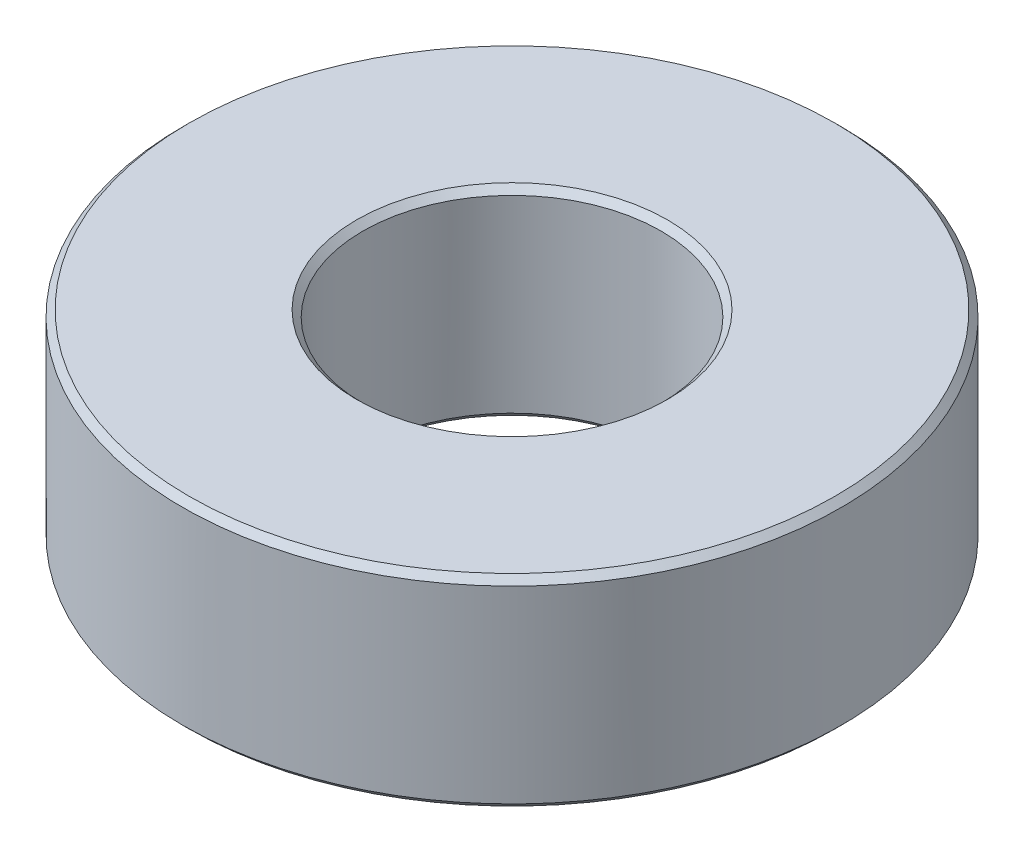
ISO-10303-21;
HEADER;
FILE_DESCRIPTION(('STEP AP214'),'2;1');
FILE_NAME('part.step','',(''),(''),'','','');
FILE_SCHEMA(('AUTOMOTIVE_DESIGN { 1 0 10303 214 1 1 1 1 }'));
ENDSEC;
DATA;
#1=APPLICATION_CONTEXT('core data for automotive mechanical design processes');
#2=APPLICATION_PROTOCOL_DEFINITION('international standard','automotive_design',2000,#1);
#3=PRODUCT_CONTEXT('',#1,'mechanical');
#4=PRODUCT('Part','Part','',(#3));
#5=PRODUCT_RELATED_PRODUCT_CATEGORY('part','',(#4));
#6=PRODUCT_DEFINITION_FORMATION('','',#4);
#7=PRODUCT_DEFINITION_CONTEXT('part definition',#1,'design');
#8=PRODUCT_DEFINITION('design','',#6,#7);
#9=PRODUCT_DEFINITION_SHAPE('','',#8);
#10=(LENGTH_UNIT() NAMED_UNIT(*) SI_UNIT(.MILLI.,.METRE.));
#11=(NAMED_UNIT(*) PLANE_ANGLE_UNIT() SI_UNIT($,.RADIAN.));
#12=(NAMED_UNIT(*) SI_UNIT($,.STERADIAN.) SOLID_ANGLE_UNIT());
#13=UNCERTAINTY_MEASURE_WITH_UNIT(LENGTH_MEASURE(1.E-05),#10,'distance_accuracy_value','');
#14=(GEOMETRIC_REPRESENTATION_CONTEXT(3) GLOBAL_UNCERTAINTY_ASSIGNED_CONTEXT((#13)) GLOBAL_UNIT_ASSIGNED_CONTEXT((#10,
#11,#12)) REPRESENTATION_CONTEXT('',''));
#15=CARTESIAN_POINT('',(0.,0.,0.));
#16=DIRECTION('',(0.,0.,1.));
#17=DIRECTION('',(1.,0.,0.));
#18=AXIS2_PLACEMENT_3D('',#15,#16,#17);
#19=CARTESIAN_POINT('',(0.,13.7566805778273,0.));
#20=DIRECTION('',(0.,-1.,0.));
#21=DIRECTION('',(0.,0.,-1.));
#22=AXIS2_PLACEMENT_3D('',#19,#20,#21);
#23=CYLINDRICAL_SURFACE('',#22,22.5);
#24=CARTESIAN_POINT('',(0.,0.439516896220526,0.));
#25=DIRECTION('',(0.,1.,0.));
#26=DIRECTION('',(0.,0.,1.));
#27=AXIS2_PLACEMENT_3D('',#24,#25,#26);
#28=CIRCLE('',#27,22.5);
#29=CARTESIAN_POINT('',(0.,0.439516896220524,-22.5));
#30=VERTEX_POINT('',#29);
#31=EDGE_CURVE('E10',#30,#30,#28,.T.);
#32=CARTESIAN_POINT('',(0.,13.3171636816068,0.));
#33=DIRECTION('',(0.,1.,0.));
#34=DIRECTION('',(0.,0.,1.));
#35=AXIS2_PLACEMENT_3D('',#32,#33,#34);
#36=CIRCLE('',#35,22.5);
#37=CARTESIAN_POINT('',(0.,13.3171636816068,-22.5));
#38=VERTEX_POINT('',#37);
#39=EDGE_CURVE('E50',#38,#38,#36,.F.);
#40=CARTESIAN_POINT('',(0.,0.439516896220524,-22.5));
#41=CARTESIAN_POINT('',(0.,0.573659050234965,-22.5));
#42=CARTESIAN_POINT('',(0.,0.707801204249406,-22.5));
#43=CARTESIAN_POINT('',(0.,0.976085512278287,-22.5));
#44=CARTESIAN_POINT('',(0.,1.11022766629273,-22.5));
#45=CARTESIAN_POINT('',(0.,1.37851197432161,-22.5));
#46=CARTESIAN_POINT('',(0.,1.51265412833605,-22.5));
#47=CARTESIAN_POINT('',(0.,1.78093843636493,-22.5));
#48=CARTESIAN_POINT('',(0.,1.91508059037937,-22.5));
#49=CARTESIAN_POINT('',(0.,2.18336489840825,-22.5));
#50=CARTESIAN_POINT('',(0.,2.31750705242269,-22.5));
#51=CARTESIAN_POINT('',(0.,2.58579136045158,-22.5));
#52=CARTESIAN_POINT('',(0.,2.71993351446602,-22.5));
#53=CARTESIAN_POINT('',(0.,2.9882178224949,-22.5));
#54=CARTESIAN_POINT('',(0.,3.12235997650934,-22.5));
#55=CARTESIAN_POINT('',(0.,3.39064428453822,-22.5));
#56=CARTESIAN_POINT('',(0.,3.52478643855266,-22.5));
#57=CARTESIAN_POINT('',(0.,3.79307074658154,-22.5));
#58=CARTESIAN_POINT('',(0.,3.92721290059598,-22.5));
#59=CARTESIAN_POINT('',(0.,4.19549720862486,-22.5));
#60=CARTESIAN_POINT('',(0.,4.3296393626393,-22.5));
#61=CARTESIAN_POINT('',(0.,4.59792367066819,-22.5));
#62=CARTESIAN_POINT('',(0.,4.73206582468263,-22.5));
#63=CARTESIAN_POINT('',(0.,5.00035013271151,-22.5));
#64=CARTESIAN_POINT('',(0.,5.13449228672595,-22.5));
#65=CARTESIAN_POINT('',(0.,5.40277659475483,-22.5));
#66=CARTESIAN_POINT('',(0.,5.53691874876927,-22.5));
#67=CARTESIAN_POINT('',(0.,5.80520305679815,-22.5));
#68=CARTESIAN_POINT('',(0.,5.93934521081259,-22.5));
#69=CARTESIAN_POINT('',(0.,6.20762951884147,-22.5));
#70=CARTESIAN_POINT('',(0.,6.34177167285592,-22.5));
#71=CARTESIAN_POINT('',(0.,6.6100559808848,-22.5));
#72=CARTESIAN_POINT('',(0.,6.74419813489924,-22.5));
#73=CARTESIAN_POINT('',(0.,7.01248244292812,-22.5));
#74=CARTESIAN_POINT('',(0.,7.14662459694256,-22.5));
#75=CARTESIAN_POINT('',(0.,7.41490890497144,-22.5));
#76=CARTESIAN_POINT('',(0.,7.54905105898588,-22.5));
#77=CARTESIAN_POINT('',(0.,7.81733536701476,-22.5));
#78=CARTESIAN_POINT('',(0.,7.9514775210292,-22.5));
#79=CARTESIAN_POINT('',(0.,8.21976182905808,-22.5));
#80=CARTESIAN_POINT('',(0.,8.35390398307253,-22.5));
#81=CARTESIAN_POINT('',(0.,8.62218829110141,-22.5));
#82=CARTESIAN_POINT('',(0.,8.75633044511585,-22.5));
#83=CARTESIAN_POINT('',(0.,9.02461475314473,-22.5));
#84=CARTESIAN_POINT('',(0.,9.15875690715917,-22.5));
#85=CARTESIAN_POINT('',(0.,9.42704121518805,-22.5));
#86=CARTESIAN_POINT('',(0.,9.56118336920249,-22.5));
#87=CARTESIAN_POINT('',(0.,9.82946767723137,-22.5));
#88=CARTESIAN_POINT('',(0.,9.96360983124581,-22.5));
#89=CARTESIAN_POINT('',(0.,10.2318941392747,-22.5));
#90=CARTESIAN_POINT('',(0.,10.3660362932891,-22.5));
#91=CARTESIAN_POINT('',(0.,10.634320601318,-22.5));
#92=CARTESIAN_POINT('',(0.,10.7684627553325,-22.5));
#93=CARTESIAN_POINT('',(0.,11.0367470633613,-22.5));
#94=CARTESIAN_POINT('',(0.,11.1708892173758,-22.5));
#95=CARTESIAN_POINT('',(0.,11.4391735254047,-22.5));
#96=CARTESIAN_POINT('',(0.,11.5733156794191,-22.5));
#97=CARTESIAN_POINT('',(0.,11.841599987448,-22.5));
#98=CARTESIAN_POINT('',(0.,11.9757421414624,-22.5));
#99=CARTESIAN_POINT('',(0.,12.2440264494913,-22.5));
#100=CARTESIAN_POINT('',(0.,12.3781686035057,-22.5));
#101=CARTESIAN_POINT('',(0.,12.6464529115346,-22.5));
#102=CARTESIAN_POINT('',(0.,12.7805950655491,-22.5));
#103=CARTESIAN_POINT('',(0.,13.0488793735779,-22.5));
#104=CARTESIAN_POINT('',(0.,13.1830215275924,-22.5));
#105=CARTESIAN_POINT('',(0.,13.3171636816068,-22.5));
#106=B_SPLINE_CURVE_WITH_KNOTS('',3,(#40,#41,#42,#43,#44,#45,#46,#47,#48,#49,#50,#51,#52,#53,
#54,#55,#56,#57,#58,#59,#60,#61,#62,#63,#64,#65,#66,#67,#68,#69,#70,#71,#72,#73,#74,#75,#76,#77,
#78,#79,#80,#81,#82,#83,#84,#85,#86,#87,#88,#89,#90,#91,#92,#93,#94,#95,#96,#97,#98,#99,#100,
#101,#102,#103,#104,#105),.UNSPECIFIED.,.F.,.F.,(4,2,2,2,2,2,2,2,2,2,2,2,2,2,2,2,2,2,2,2,2,2,2,
2,2,2,2,2,2,2,2,2,4),(0.,0.402426462043323,0.804852924086644,1.20727938612997,1.60970584817329,
2.01213231021661,2.41455877225993,2.81698523430325,3.21941169634658,3.6218381583899,
4.02426462043322,4.42669108247654,4.82911754451987,5.23154400656319,5.63397046860651,
6.03639693064983,6.43882339269315,6.84124985473648,7.2436763167798,7.64610277882312,
8.04852924086644,8.45095570290976,8.85338216495309,9.25580862699641,9.65823508903973,
10.0606615510831,10.4630880131264,10.8655144751697,11.267940937213,11.6703673992563,
12.0727938612997,12.475220323343,12.8776467853863),.UNSPECIFIED.);
#107=EDGE_CURVE('BSEAM39',#30,#38,#106,.T.);
#108=ORIENTED_EDGE('',*,*,#31,.T.);
#109=ORIENTED_EDGE('',*,*,#39,.T.);
#110=ORIENTED_EDGE('',*,*,#107,.T.);
#111=ORIENTED_EDGE('',*,*,#107,.F.);
#112=EDGE_LOOP('',(#108,#110,#109,#111));
#113=FACE_BOUND('',#112,.T.);
#114=ADVANCED_FACE('F39',(#113),#23,.T.);
#115=CARTESIAN_POINT('',(0.,13.7566805778273,0.));
#116=DIRECTION('',(0.,1.,0.));
#117=DIRECTION('',(0.,0.,1.));
#118=AXIS2_PLACEMENT_3D('',#115,#116,#117);
#119=PLANE('',#118);
#120=CARTESIAN_POINT('',(0.,13.7566805778273,0.));
#121=DIRECTION('',(0.,1.,0.));
#122=DIRECTION('',(0.,0.,1.));
#123=AXIS2_PLACEMENT_3D('',#120,#121,#122);
#124=CIRCLE('',#123,10.6208630316063);
#125=CARTESIAN_POINT('',(0.,13.7566805778273,10.6208630316063));
#126=VERTEX_POINT('',#125);
#127=EDGE_CURVE('E58',#126,#126,#124,.F.);
#128=ORIENTED_EDGE('',*,*,#127,.T.);
#129=EDGE_LOOP('',(#128));
#130=FACE_BOUND('',#129,.T.);
#131=CARTESIAN_POINT('',(0.,13.7566805778273,0.));
#132=DIRECTION('',(0.,1.,0.));
#133=DIRECTION('',(0.,0.,1.));
#134=AXIS2_PLACEMENT_3D('',#131,#132,#133);
#135=CIRCLE('',#134,22.0604831037795);
#136=CARTESIAN_POINT('',(0.,13.7566805778273,22.0604831037795));
#137=VERTEX_POINT('',#136);
#138=EDGE_CURVE('E61',#137,#137,#135,.T.);
#139=ORIENTED_EDGE('',*,*,#138,.T.);
#140=EDGE_LOOP('',(#139));
#141=FACE_BOUND('',#140,.T.);
#142=ADVANCED_FACE('F88',(#130,#141),#119,.T.);
#143=CARTESIAN_POINT('',(0.,0.,0.));
#144=DIRECTION('',(0.,1.,0.));
#145=DIRECTION('',(0.,0.,1.));
#146=AXIS2_PLACEMENT_3D('',#143,#144,#145);
#147=PLANE('',#146);
#148=CARTESIAN_POINT('',(0.,0.,0.));
#149=DIRECTION('',(0.,1.,0.));
#150=DIRECTION('',(0.,0.,1.));
#151=AXIS2_PLACEMENT_3D('',#148,#149,#150);
#152=CIRCLE('',#151,10.6208630316063);
#153=CARTESIAN_POINT('',(0.,0.,10.6208630316063));
#154=VERTEX_POINT('',#153);
#155=EDGE_CURVE('E51',#154,#154,#152,.T.);
#156=ORIENTED_EDGE('',*,*,#155,.T.);
#157=EDGE_LOOP('',(#156));
#158=FACE_BOUND('',#157,.T.);
#159=CARTESIAN_POINT('',(0.,0.,0.));
#160=DIRECTION('',(0.,1.,0.));
#161=DIRECTION('',(0.,0.,1.));
#162=AXIS2_PLACEMENT_3D('',#159,#160,#161);
#163=CIRCLE('',#162,22.0604831037795);
#164=CARTESIAN_POINT('',(0.,0.,22.0604831037795));
#165=VERTEX_POINT('',#164);
#166=EDGE_CURVE('E54',#165,#165,#163,.F.);
#167=ORIENTED_EDGE('',*,*,#166,.T.);
#168=EDGE_LOOP('',(#167));
#169=FACE_BOUND('',#168,.T.);
#170=ADVANCED_FACE('F83',(#158,#169),#147,.F.);
#171=CARTESIAN_POINT('',(0.,13.7566805778273,0.));
#172=DIRECTION('',(0.,-1.,0.));
#173=DIRECTION('',(0.,0.,-1.));
#174=AXIS2_PLACEMENT_3D('',#171,#172,#173);
#175=CYLINDRICAL_SURFACE('',#174,10.1813461353858);
#176=CARTESIAN_POINT('',(0.,13.3171636816068,0.));
#177=DIRECTION('',(0.,1.,0.));
#178=DIRECTION('',(0.,0.,1.));
#179=AXIS2_PLACEMENT_3D('',#176,#177,#178);
#180=CIRCLE('',#179,10.1813461353858);
#181=CARTESIAN_POINT('',(0.,13.3171636816068,-10.1813461353858));
#182=VERTEX_POINT('',#181);
#183=EDGE_CURVE('E67',#182,#182,#180,.T.);
#184=CARTESIAN_POINT('',(0.,0.439516896220482,0.));
#185=DIRECTION('',(0.,1.,0.));
#186=DIRECTION('',(0.,0.,1.));
#187=AXIS2_PLACEMENT_3D('',#184,#185,#186);
#188=CIRCLE('',#187,10.1813461353858);
#189=CARTESIAN_POINT('',(0.,0.439516896220482,-10.1813461353858));
#190=VERTEX_POINT('',#189);
#191=EDGE_CURVE('E69',#190,#190,#188,.F.);
#192=CARTESIAN_POINT('',(0.,13.3171636816068,-10.1813461353858));
#193=CARTESIAN_POINT('',(0.,13.1830215275924,-10.1813461353858));
#194=CARTESIAN_POINT('',(0.,13.0488793735779,-10.1813461353858));
#195=CARTESIAN_POINT('',(0.,12.780595065549,-10.1813461353858));
#196=CARTESIAN_POINT('',(0.,12.6464529115346,-10.1813461353858));
#197=CARTESIAN_POINT('',(0.,12.3781686035057,-10.1813461353858));
#198=CARTESIAN_POINT('',(0.,12.2440264494913,-10.1813461353858));
#199=CARTESIAN_POINT('',(0.,11.9757421414624,-10.1813461353858));
#200=CARTESIAN_POINT('',(0.,11.841599987448,-10.1813461353858));
#201=CARTESIAN_POINT('',(0.,11.5733156794191,-10.1813461353858));
#202=CARTESIAN_POINT('',(0.,11.4391735254046,-10.1813461353858));
#203=CARTESIAN_POINT('',(0.,11.1708892173758,-10.1813461353858));
#204=CARTESIAN_POINT('',(0.,11.0367470633613,-10.1813461353858));
#205=CARTESIAN_POINT('',(0.,10.7684627553324,-10.1813461353858));
#206=CARTESIAN_POINT('',(0.,10.634320601318,-10.1813461353858));
#207=CARTESIAN_POINT('',(0.,10.3660362932891,-10.1813461353858));
#208=CARTESIAN_POINT('',(0.,10.2318941392747,-10.1813461353858));
#209=CARTESIAN_POINT('',(0.,9.96360983124579,-10.1813461353858));
#210=CARTESIAN_POINT('',(0.,9.82946767723134,-10.1813461353858));
#211=CARTESIAN_POINT('',(0.,9.56118336920246,-10.1813461353858));
#212=CARTESIAN_POINT('',(0.,9.42704121518802,-10.1813461353858));
#213=CARTESIAN_POINT('',(0.,9.15875690715914,-10.1813461353858));
#214=CARTESIAN_POINT('',(0.,9.0246147531447,-10.1813461353858));
#215=CARTESIAN_POINT('',(0.,8.75633044511582,-10.1813461353858));
#216=CARTESIAN_POINT('',(0.,8.62218829110138,-10.1813461353858));
#217=CARTESIAN_POINT('',(0.,8.35390398307249,-10.1813461353858));
#218=CARTESIAN_POINT('',(0.,8.21976182905805,-10.1813461353858));
#219=CARTESIAN_POINT('',(0.,7.95147752102917,-10.1813461353858));
#220=CARTESIAN_POINT('',(0.,7.81733536701473,-10.1813461353858));
#221=CARTESIAN_POINT('',(0.,7.54905105898585,-10.1813461353858));
#222=CARTESIAN_POINT('',(0.,7.41490890497141,-10.1813461353858));
#223=CARTESIAN_POINT('',(0.,7.14662459694253,-10.1813461353858));
#224=CARTESIAN_POINT('',(0.,7.01248244292809,-10.1813461353858));
#225=CARTESIAN_POINT('',(0.,6.7441981348992,-10.1813461353858));
#226=CARTESIAN_POINT('',(0.,6.61005598088476,-10.1813461353858));
#227=CARTESIAN_POINT('',(0.,6.34177167285588,-10.1813461353858));
#228=CARTESIAN_POINT('',(0.,6.20762951884144,-10.1813461353858));
#229=CARTESIAN_POINT('',(0.,5.93934521081256,-10.1813461353858));
#230=CARTESIAN_POINT('',(0.,5.80520305679812,-10.1813461353858));
#231=CARTESIAN_POINT('',(0.,5.53691874876924,-10.1813461353858));
#232=CARTESIAN_POINT('',(0.,5.40277659475479,-10.1813461353858));
#233=CARTESIAN_POINT('',(0.,5.13449228672591,-10.1813461353858));
#234=CARTESIAN_POINT('',(0.,5.00035013271147,-10.1813461353858));
#235=CARTESIAN_POINT('',(0.,4.73206582468259,-10.1813461353858));
#236=CARTESIAN_POINT('',(0.,4.59792367066815,-10.1813461353858));
#237=CARTESIAN_POINT('',(0.,4.32963936263927,-10.1813461353858));
#238=CARTESIAN_POINT('',(0.,4.19549720862483,-10.1813461353858));
#239=CARTESIAN_POINT('',(0.,3.92721290059595,-10.1813461353858));
#240=CARTESIAN_POINT('',(0.,3.79307074658151,-10.1813461353858));
#241=CARTESIAN_POINT('',(0.,3.52478643855262,-10.1813461353858));
#242=CARTESIAN_POINT('',(0.,3.39064428453818,-10.1813461353858));
#243=CARTESIAN_POINT('',(0.,3.1223599765093,-10.1813461353858));
#244=CARTESIAN_POINT('',(0.,2.98821782249486,-10.1813461353858));
#245=CARTESIAN_POINT('',(0.,2.71993351446598,-10.1813461353858));
#246=CARTESIAN_POINT('',(0.,2.58579136045154,-10.1813461353858));
#247=CARTESIAN_POINT('',(0.,2.31750705242265,-10.1813461353858));
#248=CARTESIAN_POINT('',(0.,2.18336489840821,-10.1813461353858));
#249=CARTESIAN_POINT('',(0.,1.91508059037933,-10.1813461353858));
#250=CARTESIAN_POINT('',(0.,1.78093843636489,-10.1813461353858));
#251=CARTESIAN_POINT('',(0.,1.51265412833601,-10.1813461353858));
#252=CARTESIAN_POINT('',(0.,1.37851197432157,-10.1813461353858));
#253=CARTESIAN_POINT('',(0.,1.11022766629269,-10.1813461353858));
#254=CARTESIAN_POINT('',(0.,0.976085512278247,-10.1813461353858));
#255=CARTESIAN_POINT('',(0.,0.707801204249365,-10.1813461353858));
#256=CARTESIAN_POINT('',(0.,0.573659050234924,-10.1813461353858));
#257=CARTESIAN_POINT('',(0.,0.439516896220482,-10.1813461353858));
#258=B_SPLINE_CURVE_WITH_KNOTS('',3,(#192,#193,#194,#195,#196,#197,#198,#199,#200,#201,#202,
#203,#204,#205,#206,#207,#208,#209,#210,#211,#212,#213,#214,#215,#216,#217,#218,#219,#220,#221,
#222,#223,#224,#225,#226,#227,#228,#229,#230,#231,#232,#233,#234,#235,#236,#237,#238,#239,#240,
#241,#242,#243,#244,#245,#246,#247,#248,#249,#250,#251,#252,#253,#254,#255,#256,#257),
.UNSPECIFIED.,.F.,.F.,(4,2,2,2,2,2,2,2,2,2,2,2,2,2,2,2,2,2,2,2,2,2,2,2,2,2,2,2,2,2,2,2,4),(0.,
0.402426462043323,0.804852924086646,1.20727938612997,1.60970584817329,2.01213231021661,
2.41455877225994,2.81698523430326,3.21941169634658,3.6218381583899,4.02426462043323,
4.42669108247655,4.82911754451987,5.23154400656319,5.63397046860652,6.03639693064984,
6.43882339269316,6.84124985473649,7.24367631677981,7.64610277882313,8.04852924086645,
8.45095570290978,8.8533821649531,9.25580862699642,9.65823508903974,10.0606615510831,
10.4630880131264,10.8655144751697,11.267940937213,11.6703673992564,12.0727938612997,
12.475220323343,12.8776467853863),.UNSPECIFIED.);
#259=EDGE_CURVE('BSEAM71',#182,#190,#258,.T.);
#260=ORIENTED_EDGE('',*,*,#183,.T.);
#261=ORIENTED_EDGE('',*,*,#191,.T.);
#262=ORIENTED_EDGE('',*,*,#259,.T.);
#263=ORIENTED_EDGE('',*,*,#259,.F.);
#264=EDGE_LOOP('',(#260,#262,#261,#263));
#265=FACE_BOUND('',#264,.T.);
#266=ADVANCED_FACE('F71',(#265),#175,.F.);
#267=CARTESIAN_POINT('',(0.,13.3171636816068,0.));
#268=DIRECTION('',(0.,1.,0.));
#269=DIRECTION('',(0.,0.,1.));
#270=AXIS2_PLACEMENT_3D('',#267,#268,#269);
#271=CONICAL_SURFACE('',#270,10.1813461353858,0.78539816339746);
#272=ORIENTED_EDGE('',*,*,#127,.F.);
#273=EDGE_LOOP('',(#272));
#274=FACE_BOUND('',#273,.T.);
#275=ORIENTED_EDGE('',*,*,#183,.F.);
#276=EDGE_LOOP('',(#275));
#277=FACE_BOUND('',#276,.T.);
#278=ADVANCED_FACE('F77',(#274,#277),#271,.F.);
#279=CARTESIAN_POINT('',(0.,0.,0.));
#280=DIRECTION('',(0.,-1.,0.));
#281=DIRECTION('',(0.,0.,-1.));
#282=AXIS2_PLACEMENT_3D('',#279,#280,#281);
#283=CONICAL_SURFACE('',#282,10.6208630316063,0.785398163397437);
#284=ORIENTED_EDGE('',*,*,#191,.F.);
#285=EDGE_LOOP('',(#284));
#286=FACE_BOUND('',#285,.T.);
#287=ORIENTED_EDGE('',*,*,#155,.F.);
#288=EDGE_LOOP('',(#287));
#289=FACE_BOUND('',#288,.T.);
#290=ADVANCED_FACE('F73',(#286,#289),#283,.F.);
#291=CARTESIAN_POINT('',(0.,0.439516896220526,0.));
#292=DIRECTION('',(0.,1.,0.));
#293=DIRECTION('',(0.,0.,1.));
#294=AXIS2_PLACEMENT_3D('',#291,#292,#293);
#295=CONICAL_SURFACE('',#294,22.5,0.785398163397452);
#296=ORIENTED_EDGE('',*,*,#166,.F.);
#297=EDGE_LOOP('',(#296));
#298=FACE_BOUND('',#297,.T.);
#299=ORIENTED_EDGE('',*,*,#31,.F.);
#300=EDGE_LOOP('',(#299));
#301=FACE_BOUND('',#300,.T.);
#302=ADVANCED_FACE('F76',(#298,#301),#295,.T.);
#303=CARTESIAN_POINT('',(0.,13.7566805778273,0.));
#304=DIRECTION('',(0.,-1.,0.));
#305=DIRECTION('',(0.,0.,-1.));
#306=AXIS2_PLACEMENT_3D('',#303,#304,#305);
#307=CONICAL_SURFACE('',#306,22.0604831037795,0.785398163397452);
#308=ORIENTED_EDGE('',*,*,#39,.F.);
#309=EDGE_LOOP('',(#308));
#310=FACE_BOUND('',#309,.T.);
#311=ORIENTED_EDGE('',*,*,#138,.F.);
#312=EDGE_LOOP('',(#311));
#313=FACE_BOUND('',#312,.T.);
#314=ADVANCED_FACE('F45',(#310,#313),#307,.T.);
#315=CLOSED_SHELL('',(#114,#142,#170,#266,#278,#290,#302,#314));
#316=MANIFOLD_SOLID_BREP('B2',#315);
#317=ADVANCED_BREP_SHAPE_REPRESENTATION('',(#18,#316),#14);
#318=SHAPE_DEFINITION_REPRESENTATION(#9,#317);
ENDSEC;
END-ISO-10303-21;
